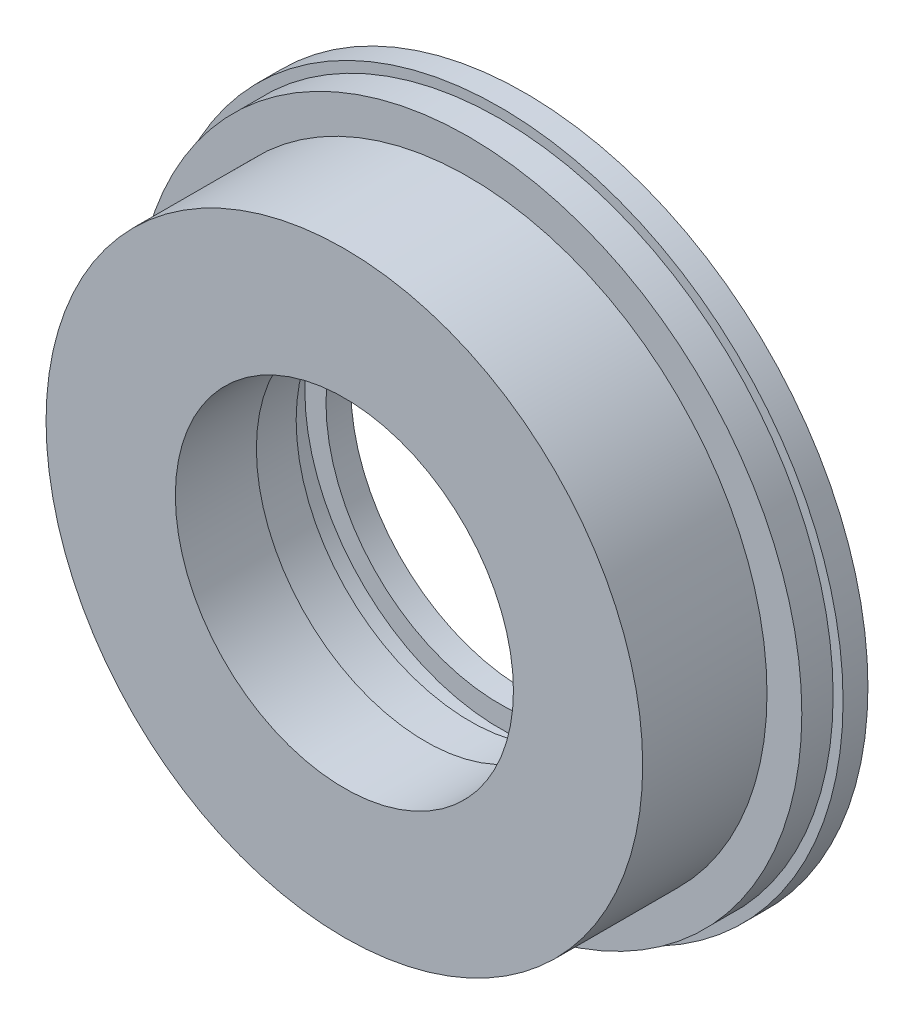
ISO-10303-21;
HEADER;
FILE_DESCRIPTION(('STEP AP214'),'2;1');
FILE_NAME('part.step','',(''),(''),'','','');
FILE_SCHEMA(('AUTOMOTIVE_DESIGN { 1 0 10303 214 1 1 1 1 }'));
ENDSEC;
DATA;
#1=APPLICATION_CONTEXT('core data for automotive mechanical design processes');
#2=APPLICATION_PROTOCOL_DEFINITION('international standard','automotive_design',2000,#1);
#3=PRODUCT_CONTEXT('',#1,'mechanical');
#4=PRODUCT('Part','Part','',(#3));
#5=PRODUCT_RELATED_PRODUCT_CATEGORY('part','',(#4));
#6=PRODUCT_DEFINITION_FORMATION('','',#4);
#7=PRODUCT_DEFINITION_CONTEXT('part definition',#1,'design');
#8=PRODUCT_DEFINITION('design','',#6,#7);
#9=PRODUCT_DEFINITION_SHAPE('','',#8);
#10=(LENGTH_UNIT() NAMED_UNIT(*) SI_UNIT(.MILLI.,.METRE.));
#11=(NAMED_UNIT(*) PLANE_ANGLE_UNIT() SI_UNIT($,.RADIAN.));
#12=(NAMED_UNIT(*) SI_UNIT($,.STERADIAN.) SOLID_ANGLE_UNIT());
#13=UNCERTAINTY_MEASURE_WITH_UNIT(LENGTH_MEASURE(1.E-05),#10,'distance_accuracy_value','');
#14=(GEOMETRIC_REPRESENTATION_CONTEXT(3) GLOBAL_UNCERTAINTY_ASSIGNED_CONTEXT((#13)) GLOBAL_UNIT_ASSIGNED_CONTEXT((#10,
#11,#12)) REPRESENTATION_CONTEXT('',''));
#15=CARTESIAN_POINT('',(0.,0.,0.));
#16=DIRECTION('',(0.,0.,1.));
#17=DIRECTION('',(1.,0.,0.));
#18=AXIS2_PLACEMENT_3D('',#15,#16,#17);
#19=CARTESIAN_POINT('',(0.,0.,0.));
#20=DIRECTION('',(0.,0.,1.));
#21=DIRECTION('',(1.,0.,0.));
#22=AXIS2_PLACEMENT_3D('',#19,#20,#21);
#23=CYLINDRICAL_SURFACE('',#22,35.);
#24=CARTESIAN_POINT('',(0.,0.,-20.));
#25=DIRECTION('',(0.,0.,1.));
#26=DIRECTION('',(1.,0.,0.));
#27=AXIS2_PLACEMENT_3D('',#24,#25,#26);
#28=CIRCLE('',#27,35.);
#29=CARTESIAN_POINT('',(35.,0.,-20.));
#30=VERTEX_POINT('',#29);
#31=EDGE_CURVE('E60',#30,#30,#28,.T.);
#32=ORIENTED_EDGE('',*,*,#31,.T.);
#33=EDGE_LOOP('',(#32));
#34=FACE_BOUND('',#33,.T.);
#35=CARTESIAN_POINT('',(0.,0.,-29.));
#36=DIRECTION('',(0.,0.,-1.));
#37=DIRECTION('',(-1.,0.,0.));
#38=AXIS2_PLACEMENT_3D('',#35,#36,#37);
#39=CIRCLE('',#38,35.);
#40=CARTESIAN_POINT('',(-35.,0.,-29.));
#41=VERTEX_POINT('',#40);
#42=EDGE_CURVE('E57',#41,#41,#39,.T.);
#43=ORIENTED_EDGE('',*,*,#42,.T.);
#44=EDGE_LOOP('',(#43));
#45=FACE_BOUND('',#44,.T.);
#46=ADVANCED_FACE('F33',(#34,#45),#23,.F.);
#47=CARTESIAN_POINT('',(0.,0.,-40.));
#48=DIRECTION('',(0.,0.,1.));
#49=DIRECTION('',(1.,0.,0.));
#50=AXIS2_PLACEMENT_3D('',#47,#48,#49);
#51=CIRCLE('',#50,35.);
#52=CARTESIAN_POINT('',(35.,0.,-40.));
#53=VERTEX_POINT('',#52);
#54=EDGE_CURVE('E50',#53,#53,#51,.F.);
#55=ORIENTED_EDGE('',*,*,#54,.T.);
#56=EDGE_LOOP('',(#55));
#57=FACE_BOUND('',#56,.T.);
#58=CARTESIAN_POINT('',(0.,0.,-35.));
#59=DIRECTION('',(0.,0.,1.));
#60=DIRECTION('',(1.,0.,0.));
#61=AXIS2_PLACEMENT_3D('',#58,#59,#60);
#62=CIRCLE('',#61,35.);
#63=CARTESIAN_POINT('',(35.,0.,-35.));
#64=VERTEX_POINT('',#63);
#65=EDGE_CURVE('E55',#64,#64,#62,.T.);
#66=ORIENTED_EDGE('',*,*,#65,.T.);
#67=EDGE_LOOP('',(#66));
#68=FACE_BOUND('',#67,.T.);
#69=ADVANCED_FACE('F93',(#57,#68),#23,.F.);
#70=CARTESIAN_POINT('',(0.,0.,0.));
#71=DIRECTION('',(0.,0.,1.));
#72=DIRECTION('',(1.,0.,0.));
#73=AXIS2_PLACEMENT_3D('',#70,#71,#72);
#74=CYLINDRICAL_SURFACE('',#73,69.);
#75=CARTESIAN_POINT('',(0.,0.,-40.));
#76=DIRECTION('',(0.,0.,1.));
#77=DIRECTION('',(1.,0.,0.));
#78=AXIS2_PLACEMENT_3D('',#75,#76,#77);
#79=CIRCLE('',#78,69.);
#80=CARTESIAN_POINT('',(69.,0.,-40.));
#81=VERTEX_POINT('',#80);
#82=EDGE_CURVE('E10',#81,#81,#79,.T.);
#83=ORIENTED_EDGE('',*,*,#82,.T.);
#84=EDGE_LOOP('',(#83));
#85=FACE_BOUND('',#84,.T.);
#86=CARTESIAN_POINT('',(0.,0.,-35.));
#87=DIRECTION('',(0.,0.,1.));
#88=DIRECTION('',(1.,0.,0.));
#89=AXIS2_PLACEMENT_3D('',#86,#87,#88);
#90=CIRCLE('',#89,69.);
#91=CARTESIAN_POINT('',(69.,0.,-35.));
#92=VERTEX_POINT('',#91);
#93=EDGE_CURVE('E41',#92,#92,#90,.T.);
#94=ORIENTED_EDGE('',*,*,#93,.F.);
#95=EDGE_LOOP('',(#94));
#96=FACE_BOUND('',#95,.T.);
#97=ADVANCED_FACE('F84',(#85,#96),#74,.T.);
#98=CARTESIAN_POINT('',(-69.,0.,-35.));
#99=DIRECTION('',(0.,0.,1.));
#100=DIRECTION('',(1.,0.,0.));
#101=AXIS2_PLACEMENT_3D('',#98,#99,#100);
#102=PLANE('',#101);
#103=ORIENTED_EDGE('',*,*,#93,.T.);
#104=EDGE_LOOP('',(#103));
#105=FACE_BOUND('',#104,.T.);
#106=CARTESIAN_POINT('',(0.,0.,-35.));
#107=DIRECTION('',(0.,0.,1.));
#108=DIRECTION('',(1.,0.,0.));
#109=AXIS2_PLACEMENT_3D('',#106,#107,#108);
#110=CIRCLE('',#109,67.);
#111=CARTESIAN_POINT('',(67.,0.,-35.));
#112=VERTEX_POINT('',#111);
#113=EDGE_CURVE('E46',#112,#112,#110,.T.);
#114=ORIENTED_EDGE('',*,*,#113,.F.);
#115=EDGE_LOOP('',(#114));
#116=FACE_BOUND('',#115,.T.);
#117=ADVANCED_FACE('F82',(#105,#116),#102,.T.);
#118=CARTESIAN_POINT('',(0.,0.,0.));
#119=DIRECTION('',(0.,0.,1.));
#120=DIRECTION('',(1.,0.,0.));
#121=AXIS2_PLACEMENT_3D('',#118,#119,#120);
#122=CYLINDRICAL_SURFACE('',#121,67.);
#123=ORIENTED_EDGE('',*,*,#113,.T.);
#124=EDGE_LOOP('',(#123));
#125=FACE_BOUND('',#124,.T.);
#126=CARTESIAN_POINT('',(0.,0.,-28.7));
#127=DIRECTION('',(0.,0.,1.));
#128=DIRECTION('',(1.,0.,0.));
#129=AXIS2_PLACEMENT_3D('',#126,#127,#128);
#130=CIRCLE('',#129,67.);
#131=CARTESIAN_POINT('',(67.,0.,-28.7));
#132=VERTEX_POINT('',#131);
#133=EDGE_CURVE('E74',#132,#132,#130,.T.);
#134=ORIENTED_EDGE('',*,*,#133,.F.);
#135=EDGE_LOOP('',(#134));
#136=FACE_BOUND('',#135,.T.);
#137=ADVANCED_FACE('F79',(#125,#136),#122,.T.);
#138=CARTESIAN_POINT('',(-67.,0.,-28.7));
#139=DIRECTION('',(0.,0.,1.));
#140=DIRECTION('',(1.,0.,0.));
#141=AXIS2_PLACEMENT_3D('',#138,#139,#140);
#142=PLANE('',#141);
#143=ORIENTED_EDGE('',*,*,#133,.T.);
#144=EDGE_LOOP('',(#143));
#145=FACE_BOUND('',#144,.T.);
#146=CARTESIAN_POINT('',(0.,0.,-28.7));
#147=DIRECTION('',(0.,0.,1.));
#148=DIRECTION('',(1.,0.,0.));
#149=AXIS2_PLACEMENT_3D('',#146,#147,#148);
#150=CIRCLE('',#149,60.);
#151=CARTESIAN_POINT('',(60.,0.,-28.7));
#152=VERTEX_POINT('',#151);
#153=EDGE_CURVE('E53',#152,#152,#150,.T.);
#154=ORIENTED_EDGE('',*,*,#153,.F.);
#155=EDGE_LOOP('',(#154));
#156=FACE_BOUND('',#155,.T.);
#157=ADVANCED_FACE('F91',(#145,#156),#142,.T.);
#158=CARTESIAN_POINT('',(0.,0.,0.));
#159=DIRECTION('',(0.,0.,1.));
#160=DIRECTION('',(1.,0.,0.));
#161=AXIS2_PLACEMENT_3D('',#158,#159,#160);
#162=CYLINDRICAL_SURFACE('',#161,60.);
#163=ORIENTED_EDGE('',*,*,#153,.T.);
#164=EDGE_LOOP('',(#163));
#165=FACE_BOUND('',#164,.T.);
#166=CARTESIAN_POINT('',(0.,0.,-3.7));
#167=DIRECTION('',(0.,0.,-1.));
#168=DIRECTION('',(-1.,0.,0.));
#169=AXIS2_PLACEMENT_3D('',#166,#167,#168);
#170=CIRCLE('',#169,60.);
#171=CARTESIAN_POINT('',(-60.,0.,-3.7));
#172=VERTEX_POINT('',#171);
#173=EDGE_CURVE('E126',#172,#172,#170,.F.);
#174=ORIENTED_EDGE('',*,*,#173,.F.);
#175=EDGE_LOOP('',(#174));
#176=FACE_BOUND('',#175,.T.);
#177=ADVANCED_FACE('F112',(#165,#176),#162,.T.);
#178=CARTESIAN_POINT('',(0.,0.,-40.));
#179=DIRECTION('',(0.,0.,1.));
#180=DIRECTION('',(1.,0.,0.));
#181=AXIS2_PLACEMENT_3D('',#178,#179,#180);
#182=PLANE('',#181);
#183=ORIENTED_EDGE('',*,*,#54,.F.);
#184=EDGE_LOOP('',(#183));
#185=FACE_BOUND('',#184,.T.);
#186=ORIENTED_EDGE('',*,*,#82,.F.);
#187=EDGE_LOOP('',(#186));
#188=FACE_BOUND('',#187,.T.);
#189=ADVANCED_FACE('F35',(#185,#188),#182,.F.);
#190=CARTESIAN_POINT('',(0.,0.,0.));
#191=DIRECTION('',(0.,0.,1.));
#192=DIRECTION('',(1.,0.,0.));
#193=AXIS2_PLACEMENT_3D('',#190,#191,#192);
#194=CYLINDRICAL_SURFACE('',#193,34.);
#195=CARTESIAN_POINT('',(0.,0.,-3.7));
#196=DIRECTION('',(0.,0.,-1.));
#197=DIRECTION('',(-1.,0.,0.));
#198=AXIS2_PLACEMENT_3D('',#195,#196,#197);
#199=CIRCLE('',#198,34.);
#200=CARTESIAN_POINT('',(-34.,0.,-3.7));
#201=VERTEX_POINT('',#200);
#202=EDGE_CURVE('E37',#201,#201,#199,.T.);
#203=ORIENTED_EDGE('',*,*,#202,.F.);
#204=EDGE_LOOP('',(#203));
#205=FACE_BOUND('',#204,.T.);
#206=CARTESIAN_POINT('',(0.,0.,-20.));
#207=DIRECTION('',(0.,0.,1.));
#208=DIRECTION('',(1.,0.,0.));
#209=AXIS2_PLACEMENT_3D('',#206,#207,#208);
#210=CIRCLE('',#209,34.);
#211=CARTESIAN_POINT('',(34.,0.,-20.));
#212=VERTEX_POINT('',#211);
#213=EDGE_CURVE('E54',#212,#212,#210,.T.);
#214=ORIENTED_EDGE('',*,*,#213,.F.);
#215=EDGE_LOOP('',(#214));
#216=FACE_BOUND('',#215,.T.);
#217=ADVANCED_FACE('F107',(#205,#216),#194,.F.);
#218=CARTESIAN_POINT('',(-35.,0.,-20.));
#219=DIRECTION('',(0.,0.,-1.));
#220=DIRECTION('',(-1.,0.,0.));
#221=AXIS2_PLACEMENT_3D('',#218,#219,#220);
#222=PLANE('',#221);
#223=ORIENTED_EDGE('',*,*,#213,.T.);
#224=EDGE_LOOP('',(#223));
#225=FACE_BOUND('',#224,.T.);
#226=ORIENTED_EDGE('',*,*,#31,.F.);
#227=EDGE_LOOP('',(#226));
#228=FACE_BOUND('',#227,.T.);
#229=ADVANCED_FACE('F104',(#225,#228),#222,.T.);
#230=CARTESIAN_POINT('',(-13.0160695192021,0.,-29.));
#231=DIRECTION('',(0.,0.,-1.));
#232=DIRECTION('',(-1.,0.,0.));
#233=AXIS2_PLACEMENT_3D('',#230,#231,#232);
#234=PLANE('',#233);
#235=ORIENTED_EDGE('',*,*,#42,.F.);
#236=EDGE_LOOP('',(#235));
#237=FACE_BOUND('',#236,.T.);
#238=CARTESIAN_POINT('',(0.,0.,-29.));
#239=DIRECTION('',(0.,0.,1.));
#240=DIRECTION('',(1.,0.,0.));
#241=AXIS2_PLACEMENT_3D('',#238,#239,#240);
#242=CIRCLE('',#241,39.25);
#243=CARTESIAN_POINT('',(39.25,0.,-29.));
#244=VERTEX_POINT('',#243);
#245=EDGE_CURVE('E58',#244,#244,#242,.T.);
#246=ORIENTED_EDGE('',*,*,#245,.F.);
#247=EDGE_LOOP('',(#246));
#248=FACE_BOUND('',#247,.T.);
#249=ADVANCED_FACE('F102',(#237,#248),#234,.T.);
#250=CARTESIAN_POINT('',(0.,0.,0.));
#251=DIRECTION('',(0.,0.,1.));
#252=DIRECTION('',(1.,0.,0.));
#253=AXIS2_PLACEMENT_3D('',#250,#251,#252);
#254=CYLINDRICAL_SURFACE('',#253,39.25);
#255=ORIENTED_EDGE('',*,*,#245,.T.);
#256=EDGE_LOOP('',(#255));
#257=FACE_BOUND('',#256,.T.);
#258=CARTESIAN_POINT('',(0.,0.,-35.));
#259=DIRECTION('',(0.,0.,1.));
#260=DIRECTION('',(1.,0.,0.));
#261=AXIS2_PLACEMENT_3D('',#258,#259,#260);
#262=CIRCLE('',#261,39.25);
#263=CARTESIAN_POINT('',(39.25,0.,-35.));
#264=VERTEX_POINT('',#263);
#265=EDGE_CURVE('E128',#264,#264,#262,.T.);
#266=ORIENTED_EDGE('',*,*,#265,.F.);
#267=EDGE_LOOP('',(#266));
#268=FACE_BOUND('',#267,.T.);
#269=ADVANCED_FACE('F144',(#257,#268),#254,.F.);
#270=CARTESIAN_POINT('',(-13.0160695192021,0.,-35.));
#271=DIRECTION('',(0.,0.,1.));
#272=DIRECTION('',(1.,0.,0.));
#273=AXIS2_PLACEMENT_3D('',#270,#271,#272);
#274=PLANE('',#273);
#275=ORIENTED_EDGE('',*,*,#65,.F.);
#276=EDGE_LOOP('',(#275));
#277=FACE_BOUND('',#276,.T.);
#278=ORIENTED_EDGE('',*,*,#265,.T.);
#279=EDGE_LOOP('',(#278));
#280=FACE_BOUND('',#279,.T.);
#281=ADVANCED_FACE('F139',(#277,#280),#274,.T.);
#282=CARTESIAN_POINT('',(-75.5298681959336,-86.,-3.7));
#283=DIRECTION('',(0.,0.,-1.));
#284=DIRECTION('',(-1.,0.,0.));
#285=AXIS2_PLACEMENT_3D('',#282,#283,#284);
#286=PLANE('',#285);
#287=ORIENTED_EDGE('',*,*,#173,.T.);
#288=EDGE_LOOP('',(#287));
#289=FACE_BOUND('',#288,.T.);
#290=ORIENTED_EDGE('',*,*,#202,.T.);
#291=EDGE_LOOP('',(#290));
#292=FACE_BOUND('',#291,.T.);
#293=ADVANCED_FACE('F134',(#289,#292),#286,.F.);
#294=CLOSED_SHELL('',(#46,#69,#97,#117,#137,#157,#177,#189,#217,#229,#249,#269,#281,#293));
#295=MANIFOLD_SOLID_BREP('B2',#294);
#296=ADVANCED_BREP_SHAPE_REPRESENTATION('',(#18,#295),#14);
#297=SHAPE_DEFINITION_REPRESENTATION(#9,#296);
ENDSEC;
END-ISO-10303-21;
